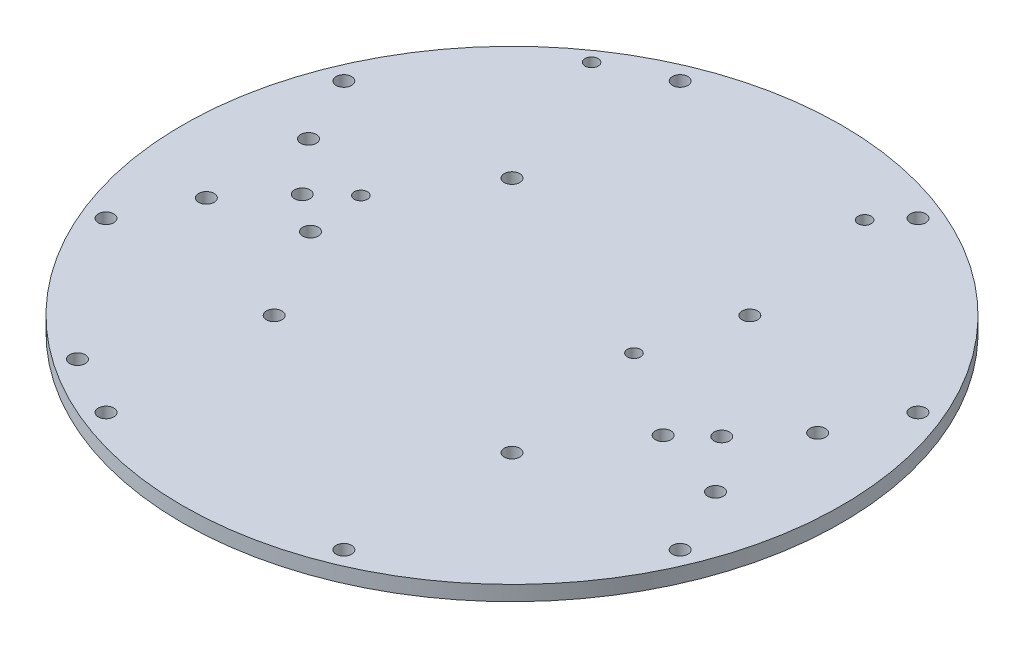
ISO-10303-21;
HEADER;
FILE_DESCRIPTION(('STEP AP214'),'2;1');
FILE_NAME('part.step','',(''),(''),'','','');
FILE_SCHEMA(('AUTOMOTIVE_DESIGN { 1 0 10303 214 1 1 1 1 }'));
ENDSEC;
DATA;
#1=APPLICATION_CONTEXT('core data for automotive mechanical design processes');
#2=APPLICATION_PROTOCOL_DEFINITION('international standard','automotive_design',2000,#1);
#3=PRODUCT_CONTEXT('',#1,'mechanical');
#4=PRODUCT('Part','Part','',(#3));
#5=PRODUCT_RELATED_PRODUCT_CATEGORY('part','',(#4));
#6=PRODUCT_DEFINITION_FORMATION('','',#4);
#7=PRODUCT_DEFINITION_CONTEXT('part definition',#1,'design');
#8=PRODUCT_DEFINITION('design','',#6,#7);
#9=PRODUCT_DEFINITION_SHAPE('','',#8);
#10=(LENGTH_UNIT() NAMED_UNIT(*) SI_UNIT(.MILLI.,.METRE.));
#11=(NAMED_UNIT(*) PLANE_ANGLE_UNIT() SI_UNIT($,.RADIAN.));
#12=(NAMED_UNIT(*) SI_UNIT($,.STERADIAN.) SOLID_ANGLE_UNIT());
#13=UNCERTAINTY_MEASURE_WITH_UNIT(LENGTH_MEASURE(1.E-05),#10,'distance_accuracy_value','');
#14=(GEOMETRIC_REPRESENTATION_CONTEXT(3) GLOBAL_UNCERTAINTY_ASSIGNED_CONTEXT((#13)) GLOBAL_UNIT_ASSIGNED_CONTEXT((#10,
#11,#12)) REPRESENTATION_CONTEXT('',''));
#15=CARTESIAN_POINT('',(0.,0.,0.));
#16=DIRECTION('',(0.,0.,1.));
#17=DIRECTION('',(1.,0.,0.));
#18=AXIS2_PLACEMENT_3D('',#15,#16,#17);
#19=CARTESIAN_POINT('',(0.,3.175,0.));
#20=DIRECTION('',(0.,1.,0.));
#21=DIRECTION('',(0.,0.,1.));
#22=AXIS2_PLACEMENT_3D('',#19,#20,#21);
#23=PLANE('',#22);
#24=CARTESIAN_POINT('',(-38.1,3.175,54.2));
#25=DIRECTION('',(0.,1.,0.));
#26=DIRECTION('',(0.,0.,1.));
#27=AXIS2_PLACEMENT_3D('',#24,#25,#26);
#28=CIRCLE('',#27,1.65);
#29=CARTESIAN_POINT('',(-38.1,3.175,55.85));
#30=VERTEX_POINT('',#29);
#31=EDGE_CURVE('E104',#30,#30,#28,.T.);
#32=ORIENTED_EDGE('',*,*,#31,.F.);
#33=EDGE_LOOP('',(#32));
#34=FACE_BOUND('',#33,.T.);
#35=CARTESIAN_POINT('',(-38.1,3.175,-6.));
#36=DIRECTION('',(0.,1.,0.));
#37=DIRECTION('',(0.,0.,1.));
#38=AXIS2_PLACEMENT_3D('',#35,#36,#37);
#39=CIRCLE('',#38,1.4);
#40=CARTESIAN_POINT('',(-38.1,3.175,-4.6));
#41=VERTEX_POINT('',#40);
#42=EDGE_CURVE('E108',#41,#41,#39,.T.);
#43=ORIENTED_EDGE('',*,*,#42,.F.);
#44=EDGE_LOOP('',(#43));
#45=FACE_BOUND('',#44,.T.);
#46=CARTESIAN_POINT('',(-38.1,3.175,-55.));
#47=DIRECTION('',(0.,1.,0.));
#48=DIRECTION('',(0.,0.,1.));
#49=AXIS2_PLACEMENT_3D('',#46,#47,#48);
#50=CIRCLE('',#49,1.4);
#51=CARTESIAN_POINT('',(-38.1,3.175,-53.6));
#52=VERTEX_POINT('',#51);
#53=EDGE_CURVE('E112',#52,#52,#50,.T.);
#54=ORIENTED_EDGE('',*,*,#53,.F.);
#55=EDGE_LOOP('',(#54));
#56=FACE_BOUND('',#55,.T.);
#57=CARTESIAN_POINT('',(19.9,3.175,-6.));
#58=DIRECTION('',(0.,1.,0.));
#59=DIRECTION('',(0.,0.,1.));
#60=AXIS2_PLACEMENT_3D('',#57,#58,#59);
#61=CIRCLE('',#60,1.4);
#62=CARTESIAN_POINT('',(19.9,3.175,-4.6));
#63=VERTEX_POINT('',#62);
#64=EDGE_CURVE('E116',#63,#63,#61,.T.);
#65=ORIENTED_EDGE('',*,*,#64,.F.);
#66=EDGE_LOOP('',(#65));
#67=FACE_BOUND('',#66,.T.);
#68=CARTESIAN_POINT('',(-36.8,3.175,6.));
#69=DIRECTION('',(0.,1.,0.));
#70=DIRECTION('',(0.,0.,1.));
#71=AXIS2_PLACEMENT_3D('',#68,#69,#70);
#72=CIRCLE('',#71,1.65);
#73=CARTESIAN_POINT('',(-36.8,3.175,7.65));
#74=VERTEX_POINT('',#73);
#75=EDGE_CURVE('E120',#74,#74,#72,.T.);
#76=ORIENTED_EDGE('',*,*,#75,.F.);
#77=EDGE_LOOP('',(#76));
#78=FACE_BOUND('',#77,.T.);
#79=CARTESIAN_POINT('',(38.1,3.175,6.));
#80=DIRECTION('',(0.,1.,0.));
#81=DIRECTION('',(0.,0.,1.));
#82=AXIS2_PLACEMENT_3D('',#79,#80,#81);
#83=CIRCLE('',#82,1.65);
#84=CARTESIAN_POINT('',(38.1,3.175,7.65));
#85=VERTEX_POINT('',#84);
#86=EDGE_CURVE('E124',#85,#85,#83,.T.);
#87=ORIENTED_EDGE('',*,*,#86,.F.);
#88=EDGE_LOOP('',(#87));
#89=FACE_BOUND('',#88,.T.);
#90=CARTESIAN_POINT('',(19.9,3.175,-55.));
#91=DIRECTION('',(0.,1.,0.));
#92=DIRECTION('',(0.,0.,1.));
#93=AXIS2_PLACEMENT_3D('',#90,#91,#92);
#94=CIRCLE('',#93,1.4);
#95=CARTESIAN_POINT('',(19.9,3.175,-53.6));
#96=VERTEX_POINT('',#95);
#97=EDGE_CURVE('E128',#96,#96,#94,.T.);
#98=ORIENTED_EDGE('',*,*,#97,.F.);
#99=EDGE_LOOP('',(#98));
#100=FACE_BOUND('',#99,.T.);
#101=CARTESIAN_POINT('',(-25.2571065360959,3.175,25.2571065360959));
#102=DIRECTION('',(0.,1.,0.));
#103=DIRECTION('',(0.,0.,1.));
#104=AXIS2_PLACEMENT_3D('',#101,#102,#103);
#105=CIRCLE('',#104,1.65);
#106=CARTESIAN_POINT('',(-25.2571065360959,3.175,26.9071065360959));
#107=VERTEX_POINT('',#106);
#108=EDGE_CURVE('E132',#107,#107,#105,.T.);
#109=ORIENTED_EDGE('',*,*,#108,.F.);
#110=EDGE_LOOP('',(#109));
#111=FACE_BOUND('',#110,.T.);
#112=CARTESIAN_POINT('',(-60.9760491457449,3.175,25.257106536096));
#113=DIRECTION('',(0.,1.,0.));
#114=DIRECTION('',(0.,0.,1.));
#115=AXIS2_PLACEMENT_3D('',#112,#113,#114);
#116=CIRCLE('',#115,1.65);
#117=CARTESIAN_POINT('',(-60.9760491457449,3.175,26.907106536096));
#118=VERTEX_POINT('',#117);
#119=EDGE_CURVE('E136',#118,#118,#116,.T.);
#120=ORIENTED_EDGE('',*,*,#119,.F.);
#121=EDGE_LOOP('',(#120));
#122=FACE_BOUND('',#121,.T.);
#123=CARTESIAN_POINT('',(-25.2571065360959,3.175,60.976049145745));
#124=DIRECTION('',(0.,1.,0.));
#125=DIRECTION('',(0.,0.,1.));
#126=AXIS2_PLACEMENT_3D('',#123,#124,#125);
#127=CIRCLE('',#126,1.65);
#128=CARTESIAN_POINT('',(-25.2571065360959,3.175,62.626049145745));
#129=VERTEX_POINT('',#128);
#130=EDGE_CURVE('E140',#129,#129,#127,.T.);
#131=ORIENTED_EDGE('',*,*,#130,.F.);
#132=EDGE_LOOP('',(#131));
#133=FACE_BOUND('',#132,.T.);
#134=CARTESIAN_POINT('',(25.2571065360959,3.175,60.976049145745));
#135=DIRECTION('',(0.,1.,0.));
#136=DIRECTION('',(0.,0.,-1.));
#137=AXIS2_PLACEMENT_3D('',#134,#135,#136);
#138=CIRCLE('',#137,1.65);
#139=CARTESIAN_POINT('',(25.2571065360959,3.175,59.326049145745));
#140=VERTEX_POINT('',#139);
#141=EDGE_CURVE('E144',#140,#140,#138,.T.);
#142=ORIENTED_EDGE('',*,*,#141,.F.);
#143=EDGE_LOOP('',(#142));
#144=FACE_BOUND('',#143,.T.);
#145=CARTESIAN_POINT('',(60.9760491457449,3.175,25.257106536096));
#146=DIRECTION('',(0.,1.,0.));
#147=DIRECTION('',(0.,0.,-1.));
#148=AXIS2_PLACEMENT_3D('',#145,#146,#147);
#149=CIRCLE('',#148,1.65);
#150=CARTESIAN_POINT('',(60.9760491457449,3.175,23.607106536096));
#151=VERTEX_POINT('',#150);
#152=EDGE_CURVE('E148',#151,#151,#149,.T.);
#153=ORIENTED_EDGE('',*,*,#152,.F.);
#154=EDGE_LOOP('',(#153));
#155=FACE_BOUND('',#154,.T.);
#156=CARTESIAN_POINT('',(25.2571065360959,3.175,25.2571065360959));
#157=DIRECTION('',(0.,1.,0.));
#158=DIRECTION('',(0.,0.,-1.));
#159=AXIS2_PLACEMENT_3D('',#156,#157,#158);
#160=CIRCLE('',#159,1.65);
#161=CARTESIAN_POINT('',(25.2571065360959,3.175,23.607106536096));
#162=VERTEX_POINT('',#161);
#163=EDGE_CURVE('E152',#162,#162,#160,.T.);
#164=ORIENTED_EDGE('',*,*,#163,.F.);
#165=EDGE_LOOP('',(#164));
#166=FACE_BOUND('',#165,.T.);
#167=CARTESIAN_POINT('',(60.9760491457449,3.175,-25.257106536096));
#168=DIRECTION('',(0.,1.,0.));
#169=DIRECTION('',(0.,0.,1.));
#170=AXIS2_PLACEMENT_3D('',#167,#168,#169);
#171=CIRCLE('',#170,1.65);
#172=CARTESIAN_POINT('',(60.9760491457449,3.175,-23.607106536096));
#173=VERTEX_POINT('',#172);
#174=EDGE_CURVE('E156',#173,#173,#171,.T.);
#175=ORIENTED_EDGE('',*,*,#174,.F.);
#176=EDGE_LOOP('',(#175));
#177=FACE_BOUND('',#176,.T.);
#178=CARTESIAN_POINT('',(25.2571065360959,3.175,-25.2571065360959));
#179=DIRECTION('',(0.,1.,0.));
#180=DIRECTION('',(0.,0.,1.));
#181=AXIS2_PLACEMENT_3D('',#178,#179,#180);
#182=CIRCLE('',#181,1.65);
#183=CARTESIAN_POINT('',(25.2571065360959,3.175,-23.6071065360959));
#184=VERTEX_POINT('',#183);
#185=EDGE_CURVE('E160',#184,#184,#182,.T.);
#186=ORIENTED_EDGE('',*,*,#185,.F.);
#187=EDGE_LOOP('',(#186));
#188=FACE_BOUND('',#187,.T.);
#189=CARTESIAN_POINT('',(-25.2571065360959,3.175,-25.2571065360959));
#190=DIRECTION('',(0.,1.,0.));
#191=DIRECTION('',(0.,0.,-1.));
#192=AXIS2_PLACEMENT_3D('',#189,#190,#191);
#193=CIRCLE('',#192,1.65);
#194=CARTESIAN_POINT('',(-25.2571065360959,3.175,-26.9071065360959));
#195=VERTEX_POINT('',#194);
#196=EDGE_CURVE('E164',#195,#195,#193,.T.);
#197=ORIENTED_EDGE('',*,*,#196,.F.);
#198=EDGE_LOOP('',(#197));
#199=FACE_BOUND('',#198,.T.);
#200=CARTESIAN_POINT('',(-60.9760491457449,3.175,-25.257106536096));
#201=DIRECTION('',(0.,1.,0.));
#202=DIRECTION('',(0.,0.,-1.));
#203=AXIS2_PLACEMENT_3D('',#200,#201,#202);
#204=CIRCLE('',#203,1.65);
#205=CARTESIAN_POINT('',(-60.9760491457449,3.175,-26.907106536096));
#206=VERTEX_POINT('',#205);
#207=EDGE_CURVE('E168',#206,#206,#204,.T.);
#208=ORIENTED_EDGE('',*,*,#207,.F.);
#209=EDGE_LOOP('',(#208));
#210=FACE_BOUND('',#209,.T.);
#211=CARTESIAN_POINT('',(-25.2571065360959,3.175,-60.976049145745));
#212=DIRECTION('',(0.,1.,0.));
#213=DIRECTION('',(0.,0.,-1.));
#214=AXIS2_PLACEMENT_3D('',#211,#212,#213);
#215=CIRCLE('',#214,1.65);
#216=CARTESIAN_POINT('',(-25.2571065360959,3.175,-62.626049145745));
#217=VERTEX_POINT('',#216);
#218=EDGE_CURVE('E172',#217,#217,#215,.T.);
#219=ORIENTED_EDGE('',*,*,#218,.F.);
#220=EDGE_LOOP('',(#219));
#221=FACE_BOUND('',#220,.T.);
#222=CARTESIAN_POINT('',(25.2571065360959,3.175,-60.976049145745));
#223=DIRECTION('',(0.,1.,0.));
#224=DIRECTION('',(0.,0.,1.));
#225=AXIS2_PLACEMENT_3D('',#222,#223,#224);
#226=CIRCLE('',#225,1.65);
#227=CARTESIAN_POINT('',(25.2571065360959,3.175,-59.326049145745));
#228=VERTEX_POINT('',#227);
#229=EDGE_CURVE('E176',#228,#228,#226,.T.);
#230=ORIENTED_EDGE('',*,*,#229,.F.);
#231=EDGE_LOOP('',(#230));
#232=FACE_BOUND('',#231,.T.);
#233=CARTESIAN_POINT('',(-54.075,3.175,-10.85));
#234=DIRECTION('',(0.,1.,0.));
#235=DIRECTION('',(0.,0.,-1.));
#236=AXIS2_PLACEMENT_3D('',#233,#234,#235);
#237=CIRCLE('',#236,1.651);
#238=CARTESIAN_POINT('',(-54.075,3.175,-12.501));
#239=VERTEX_POINT('',#238);
#240=EDGE_CURVE('E180',#239,#239,#237,.T.);
#241=ORIENTED_EDGE('',*,*,#240,.F.);
#242=EDGE_LOOP('',(#241));
#243=FACE_BOUND('',#242,.T.);
#244=CARTESIAN_POINT('',(54.075,3.175,10.85));
#245=DIRECTION('',(0.,1.,0.));
#246=DIRECTION('',(0.,0.,1.));
#247=AXIS2_PLACEMENT_3D('',#244,#245,#246);
#248=CIRCLE('',#247,1.651);
#249=CARTESIAN_POINT('',(54.075,3.175,12.501));
#250=VERTEX_POINT('',#249);
#251=EDGE_CURVE('E70',#250,#250,#248,.T.);
#252=ORIENTED_EDGE('',*,*,#251,.F.);
#253=EDGE_LOOP('',(#252));
#254=FACE_BOUND('',#253,.T.);
#255=CARTESIAN_POINT('',(44.55,3.175,0.));
#256=DIRECTION('',(0.,1.,0.));
#257=DIRECTION('',(0.,0.,1.));
#258=AXIS2_PLACEMENT_3D('',#255,#256,#257);
#259=CIRCLE('',#258,1.651);
#260=CARTESIAN_POINT('',(44.55,3.175,1.65100000000002));
#261=VERTEX_POINT('',#260);
#262=EDGE_CURVE('E50',#261,#261,#259,.T.);
#263=ORIENTED_EDGE('',*,*,#262,.F.);
#264=EDGE_LOOP('',(#263));
#265=FACE_BOUND('',#264,.T.);
#266=CARTESIAN_POINT('',(0.,3.175,0.));
#267=DIRECTION('',(0.,1.,0.));
#268=DIRECTION('',(0.,0.,1.));
#269=AXIS2_PLACEMENT_3D('',#266,#267,#268);
#270=CIRCLE('',#269,70.);
#271=CARTESIAN_POINT('',(0.,3.175,70.));
#272=VERTEX_POINT('',#271);
#273=EDGE_CURVE('E11',#272,#272,#270,.T.);
#274=ORIENTED_EDGE('',*,*,#273,.T.);
#275=EDGE_LOOP('',(#274));
#276=FACE_BOUND('',#275,.T.);
#277=CARTESIAN_POINT('',(54.075,3.175,-10.85));
#278=DIRECTION('',(0.,1.,0.));
#279=DIRECTION('',(0.,0.,1.));
#280=AXIS2_PLACEMENT_3D('',#277,#278,#279);
#281=CIRCLE('',#280,1.651);
#282=CARTESIAN_POINT('',(54.075,3.175,-9.199));
#283=VERTEX_POINT('',#282);
#284=EDGE_CURVE('E61',#283,#283,#281,.T.);
#285=ORIENTED_EDGE('',*,*,#284,.F.);
#286=EDGE_LOOP('',(#285));
#287=FACE_BOUND('',#286,.T.);
#288=CARTESIAN_POINT('',(-54.075,3.175,10.85));
#289=DIRECTION('',(0.,1.,0.));
#290=DIRECTION('',(0.,0.,-1.));
#291=AXIS2_PLACEMENT_3D('',#288,#289,#290);
#292=CIRCLE('',#291,1.651);
#293=CARTESIAN_POINT('',(-54.075,3.175,9.19900000000002));
#294=VERTEX_POINT('',#293);
#295=EDGE_CURVE('E190',#294,#294,#292,.T.);
#296=ORIENTED_EDGE('',*,*,#295,.F.);
#297=EDGE_LOOP('',(#296));
#298=FACE_BOUND('',#297,.T.);
#299=CARTESIAN_POINT('',(-44.55,3.175,0.));
#300=DIRECTION('',(0.,1.,0.));
#301=DIRECTION('',(0.,0.,-1.));
#302=AXIS2_PLACEMENT_3D('',#299,#300,#301);
#303=CIRCLE('',#302,1.651);
#304=CARTESIAN_POINT('',(-44.55,3.175,-1.65099999999997));
#305=VERTEX_POINT('',#304);
#306=EDGE_CURVE('E193',#305,#305,#303,.T.);
#307=ORIENTED_EDGE('',*,*,#306,.F.);
#308=EDGE_LOOP('',(#307));
#309=FACE_BOUND('',#308,.T.);
#310=ADVANCED_FACE('F36',(#34,#45,#56,#67,#78,#89,#100,#111,#122,#133,#144,#155,#166,#177,#188,
#199,#210,#221,#232,#243,#254,#265,#276,#287,#298,#309),#23,.T.);
#311=CARTESIAN_POINT('',(0.,0.,0.));
#312=DIRECTION('',(0.,1.,0.));
#313=DIRECTION('',(0.,0.,1.));
#314=AXIS2_PLACEMENT_3D('',#311,#312,#313);
#315=PLANE('',#314);
#316=CARTESIAN_POINT('',(-38.1,0.,54.2));
#317=DIRECTION('',(0.,1.,0.));
#318=DIRECTION('',(0.,0.,1.));
#319=AXIS2_PLACEMENT_3D('',#316,#317,#318);
#320=CIRCLE('',#319,1.65);
#321=CARTESIAN_POINT('',(-38.1,0.,55.85));
#322=VERTEX_POINT('',#321);
#323=EDGE_CURVE('E324',#322,#322,#320,.T.);
#324=ORIENTED_EDGE('',*,*,#323,.T.);
#325=EDGE_LOOP('',(#324));
#326=FACE_BOUND('',#325,.T.);
#327=CARTESIAN_POINT('',(-38.1,0.,-6.));
#328=DIRECTION('',(0.,1.,0.));
#329=DIRECTION('',(0.,0.,1.));
#330=AXIS2_PLACEMENT_3D('',#327,#328,#329);
#331=CIRCLE('',#330,1.4);
#332=CARTESIAN_POINT('',(-38.1,0.,-4.6));
#333=VERTEX_POINT('',#332);
#334=EDGE_CURVE('E445',#333,#333,#331,.T.);
#335=ORIENTED_EDGE('',*,*,#334,.T.);
#336=EDGE_LOOP('',(#335));
#337=FACE_BOUND('',#336,.T.);
#338=CARTESIAN_POINT('',(-38.1,0.,-55.));
#339=DIRECTION('',(0.,1.,0.));
#340=DIRECTION('',(0.,0.,1.));
#341=AXIS2_PLACEMENT_3D('',#338,#339,#340);
#342=CIRCLE('',#341,1.4);
#343=CARTESIAN_POINT('',(-38.1,0.,-53.6));
#344=VERTEX_POINT('',#343);
#345=EDGE_CURVE('E347',#344,#344,#342,.T.);
#346=ORIENTED_EDGE('',*,*,#345,.T.);
#347=EDGE_LOOP('',(#346));
#348=FACE_BOUND('',#347,.T.);
#349=CARTESIAN_POINT('',(19.9,0.,-6.));
#350=DIRECTION('',(0.,1.,0.));
#351=DIRECTION('',(0.,0.,1.));
#352=AXIS2_PLACEMENT_3D('',#349,#350,#351);
#353=CIRCLE('',#352,1.4);
#354=CARTESIAN_POINT('',(19.9,0.,-4.6));
#355=VERTEX_POINT('',#354);
#356=EDGE_CURVE('E441',#355,#355,#353,.T.);
#357=ORIENTED_EDGE('',*,*,#356,.T.);
#358=EDGE_LOOP('',(#357));
#359=FACE_BOUND('',#358,.T.);
#360=CARTESIAN_POINT('',(-36.8,0.,6.));
#361=DIRECTION('',(0.,1.,0.));
#362=DIRECTION('',(0.,0.,1.));
#363=AXIS2_PLACEMENT_3D('',#360,#361,#362);
#364=CIRCLE('',#363,1.65);
#365=CARTESIAN_POINT('',(-36.8,0.,7.65));
#366=VERTEX_POINT('',#365);
#367=EDGE_CURVE('E320',#366,#366,#364,.T.);
#368=ORIENTED_EDGE('',*,*,#367,.T.);
#369=EDGE_LOOP('',(#368));
#370=FACE_BOUND('',#369,.T.);
#371=CARTESIAN_POINT('',(38.1,0.,6.));
#372=DIRECTION('',(0.,1.,0.));
#373=DIRECTION('',(0.,0.,1.));
#374=AXIS2_PLACEMENT_3D('',#371,#372,#373);
#375=CIRCLE('',#374,1.65);
#376=CARTESIAN_POINT('',(38.1,0.,7.65));
#377=VERTEX_POINT('',#376);
#378=EDGE_CURVE('E327',#377,#377,#375,.T.);
#379=ORIENTED_EDGE('',*,*,#378,.T.);
#380=EDGE_LOOP('',(#379));
#381=FACE_BOUND('',#380,.T.);
#382=CARTESIAN_POINT('',(19.9,0.,-55.));
#383=DIRECTION('',(0.,1.,0.));
#384=DIRECTION('',(0.,0.,1.));
#385=AXIS2_PLACEMENT_3D('',#382,#383,#384);
#386=CIRCLE('',#385,1.4);
#387=CARTESIAN_POINT('',(19.9,0.,-53.6));
#388=VERTEX_POINT('',#387);
#389=EDGE_CURVE('E346',#388,#388,#386,.T.);
#390=ORIENTED_EDGE('',*,*,#389,.T.);
#391=EDGE_LOOP('',(#390));
#392=FACE_BOUND('',#391,.T.);
#393=CARTESIAN_POINT('',(-25.2571065360959,0.,25.2571065360959));
#394=DIRECTION('',(0.,1.,0.));
#395=DIRECTION('',(0.,0.,1.));
#396=AXIS2_PLACEMENT_3D('',#393,#394,#395);
#397=CIRCLE('',#396,1.65);
#398=CARTESIAN_POINT('',(-25.2571065360959,0.,26.9071065360959));
#399=VERTEX_POINT('',#398);
#400=EDGE_CURVE('E354',#399,#399,#397,.T.);
#401=ORIENTED_EDGE('',*,*,#400,.T.);
#402=EDGE_LOOP('',(#401));
#403=FACE_BOUND('',#402,.T.);
#404=CARTESIAN_POINT('',(-60.9760491457449,0.,25.257106536096));
#405=DIRECTION('',(0.,1.,0.));
#406=DIRECTION('',(0.,0.,1.));
#407=AXIS2_PLACEMENT_3D('',#404,#405,#406);
#408=CIRCLE('',#407,1.65);
#409=CARTESIAN_POINT('',(-60.9760491457449,0.,26.907106536096));
#410=VERTEX_POINT('',#409);
#411=EDGE_CURVE('E437',#410,#410,#408,.T.);
#412=ORIENTED_EDGE('',*,*,#411,.T.);
#413=EDGE_LOOP('',(#412));
#414=FACE_BOUND('',#413,.T.);
#415=CARTESIAN_POINT('',(-25.2571065360959,0.,60.976049145745));
#416=DIRECTION('',(0.,1.,0.));
#417=DIRECTION('',(0.,0.,1.));
#418=AXIS2_PLACEMENT_3D('',#415,#416,#417);
#419=CIRCLE('',#418,1.65);
#420=CARTESIAN_POINT('',(-25.2571065360959,0.,62.626049145745));
#421=VERTEX_POINT('',#420);
#422=EDGE_CURVE('E435',#421,#421,#419,.T.);
#423=ORIENTED_EDGE('',*,*,#422,.T.);
#424=EDGE_LOOP('',(#423));
#425=FACE_BOUND('',#424,.T.);
#426=CARTESIAN_POINT('',(25.2571065360959,0.,60.976049145745));
#427=DIRECTION('',(0.,1.,0.));
#428=DIRECTION('',(0.,0.,-1.));
#429=AXIS2_PLACEMENT_3D('',#426,#427,#428);
#430=CIRCLE('',#429,1.65);
#431=CARTESIAN_POINT('',(25.2571065360959,0.,59.326049145745));
#432=VERTEX_POINT('',#431);
#433=EDGE_CURVE('E377',#432,#432,#430,.T.);
#434=ORIENTED_EDGE('',*,*,#433,.T.);
#435=EDGE_LOOP('',(#434));
#436=FACE_BOUND('',#435,.T.);
#437=CARTESIAN_POINT('',(60.9760491457449,0.,25.257106536096));
#438=DIRECTION('',(0.,1.,0.));
#439=DIRECTION('',(0.,0.,-1.));
#440=AXIS2_PLACEMENT_3D('',#437,#438,#439);
#441=CIRCLE('',#440,1.65);
#442=CARTESIAN_POINT('',(60.9760491457449,0.,23.607106536096));
#443=VERTEX_POINT('',#442);
#444=EDGE_CURVE('E376',#443,#443,#441,.T.);
#445=ORIENTED_EDGE('',*,*,#444,.T.);
#446=EDGE_LOOP('',(#445));
#447=FACE_BOUND('',#446,.T.);
#448=CARTESIAN_POINT('',(25.2571065360959,0.,25.2571065360959));
#449=DIRECTION('',(0.,1.,0.));
#450=DIRECTION('',(0.,0.,-1.));
#451=AXIS2_PLACEMENT_3D('',#448,#449,#450);
#452=CIRCLE('',#451,1.65);
#453=CARTESIAN_POINT('',(25.2571065360959,0.,23.607106536096));
#454=VERTEX_POINT('',#453);
#455=EDGE_CURVE('E389',#454,#454,#452,.T.);
#456=ORIENTED_EDGE('',*,*,#455,.T.);
#457=EDGE_LOOP('',(#456));
#458=FACE_BOUND('',#457,.T.);
#459=CARTESIAN_POINT('',(60.9760491457449,0.,-25.257106536096));
#460=DIRECTION('',(0.,1.,0.));
#461=DIRECTION('',(0.,0.,1.));
#462=AXIS2_PLACEMENT_3D('',#459,#460,#461);
#463=CIRCLE('',#462,1.65);
#464=CARTESIAN_POINT('',(60.9760491457449,0.,-23.607106536096));
#465=VERTEX_POINT('',#464);
#466=EDGE_CURVE('E406',#465,#465,#463,.T.);
#467=ORIENTED_EDGE('',*,*,#466,.T.);
#468=EDGE_LOOP('',(#467));
#469=FACE_BOUND('',#468,.T.);
#470=CARTESIAN_POINT('',(25.2571065360959,0.,-25.2571065360959));
#471=DIRECTION('',(0.,1.,0.));
#472=DIRECTION('',(0.,0.,1.));
#473=AXIS2_PLACEMENT_3D('',#470,#471,#472);
#474=CIRCLE('',#473,1.65);
#475=CARTESIAN_POINT('',(25.2571065360959,0.,-23.6071065360959));
#476=VERTEX_POINT('',#475);
#477=EDGE_CURVE('E397',#476,#476,#474,.T.);
#478=ORIENTED_EDGE('',*,*,#477,.T.);
#479=EDGE_LOOP('',(#478));
#480=FACE_BOUND('',#479,.T.);
#481=CARTESIAN_POINT('',(-25.2571065360959,0.,-25.2571065360959));
#482=DIRECTION('',(0.,1.,0.));
#483=DIRECTION('',(0.,0.,-1.));
#484=AXIS2_PLACEMENT_3D('',#481,#482,#483);
#485=CIRCLE('',#484,1.65);
#486=CARTESIAN_POINT('',(-25.2571065360959,0.,-26.9071065360959));
#487=VERTEX_POINT('',#486);
#488=EDGE_CURVE('E355',#487,#487,#485,.T.);
#489=ORIENTED_EDGE('',*,*,#488,.T.);
#490=EDGE_LOOP('',(#489));
#491=FACE_BOUND('',#490,.T.);
#492=CARTESIAN_POINT('',(-60.9760491457449,0.,-25.257106536096));
#493=DIRECTION('',(0.,1.,0.));
#494=DIRECTION('',(0.,0.,-1.));
#495=AXIS2_PLACEMENT_3D('',#492,#493,#494);
#496=CIRCLE('',#495,1.65);
#497=CARTESIAN_POINT('',(-60.9760491457449,0.,-26.907106536096));
#498=VERTEX_POINT('',#497);
#499=EDGE_CURVE('E366',#498,#498,#496,.T.);
#500=ORIENTED_EDGE('',*,*,#499,.T.);
#501=EDGE_LOOP('',(#500));
#502=FACE_BOUND('',#501,.T.);
#503=CARTESIAN_POINT('',(-25.2571065360959,0.,-60.976049145745));
#504=DIRECTION('',(0.,1.,0.));
#505=DIRECTION('',(0.,0.,-1.));
#506=AXIS2_PLACEMENT_3D('',#503,#504,#505);
#507=CIRCLE('',#506,1.65);
#508=CARTESIAN_POINT('',(-25.2571065360959,0.,-62.626049145745));
#509=VERTEX_POINT('',#508);
#510=EDGE_CURVE('E345',#509,#509,#507,.T.);
#511=ORIENTED_EDGE('',*,*,#510,.T.);
#512=EDGE_LOOP('',(#511));
#513=FACE_BOUND('',#512,.T.);
#514=CARTESIAN_POINT('',(25.2571065360959,0.,-60.976049145745));
#515=DIRECTION('',(0.,1.,0.));
#516=DIRECTION('',(0.,0.,1.));
#517=AXIS2_PLACEMENT_3D('',#514,#515,#516);
#518=CIRCLE('',#517,1.65);
#519=CARTESIAN_POINT('',(25.2571065360959,0.,-59.326049145745));
#520=VERTEX_POINT('',#519);
#521=EDGE_CURVE('E205',#520,#520,#518,.T.);
#522=ORIENTED_EDGE('',*,*,#521,.T.);
#523=EDGE_LOOP('',(#522));
#524=FACE_BOUND('',#523,.T.);
#525=CARTESIAN_POINT('',(0.,0.,0.));
#526=DIRECTION('',(0.,1.,0.));
#527=DIRECTION('',(0.,0.,1.));
#528=AXIS2_PLACEMENT_3D('',#525,#526,#527);
#529=CIRCLE('',#528,70.);
#530=CARTESIAN_POINT('',(0.,0.,70.));
#531=VERTEX_POINT('',#530);
#532=EDGE_CURVE('E40',#531,#531,#529,.T.);
#533=ORIENTED_EDGE('',*,*,#532,.F.);
#534=EDGE_LOOP('',(#533));
#535=FACE_BOUND('',#534,.T.);
#536=CARTESIAN_POINT('',(44.55,0.,0.));
#537=DIRECTION('',(0.,1.,0.));
#538=DIRECTION('',(0.,0.,1.));
#539=AXIS2_PLACEMENT_3D('',#536,#537,#538);
#540=CIRCLE('',#539,1.651);
#541=CARTESIAN_POINT('',(44.55,0.,1.65100000000002));
#542=VERTEX_POINT('',#541);
#543=EDGE_CURVE('E53',#542,#542,#540,.T.);
#544=ORIENTED_EDGE('',*,*,#543,.T.);
#545=EDGE_LOOP('',(#544));
#546=FACE_BOUND('',#545,.T.);
#547=CARTESIAN_POINT('',(54.075,0.,-10.85));
#548=DIRECTION('',(0.,1.,0.));
#549=DIRECTION('',(0.,0.,1.));
#550=AXIS2_PLACEMENT_3D('',#547,#548,#549);
#551=CIRCLE('',#550,1.651);
#552=CARTESIAN_POINT('',(54.075,0.,-9.199));
#553=VERTEX_POINT('',#552);
#554=EDGE_CURVE('E66',#553,#553,#551,.T.);
#555=ORIENTED_EDGE('',*,*,#554,.T.);
#556=EDGE_LOOP('',(#555));
#557=FACE_BOUND('',#556,.T.);
#558=CARTESIAN_POINT('',(54.075,0.,10.85));
#559=DIRECTION('',(0.,1.,0.));
#560=DIRECTION('',(0.,0.,1.));
#561=AXIS2_PLACEMENT_3D('',#558,#559,#560);
#562=CIRCLE('',#561,1.651);
#563=CARTESIAN_POINT('',(54.075,0.,12.501));
#564=VERTEX_POINT('',#563);
#565=EDGE_CURVE('E67',#564,#564,#562,.T.);
#566=ORIENTED_EDGE('',*,*,#565,.T.);
#567=EDGE_LOOP('',(#566));
#568=FACE_BOUND('',#567,.T.);
#569=CARTESIAN_POINT('',(-54.075,0.,10.85));
#570=DIRECTION('',(0.,1.,0.));
#571=DIRECTION('',(0.,0.,-1.));
#572=AXIS2_PLACEMENT_3D('',#569,#570,#571);
#573=CIRCLE('',#572,1.651);
#574=CARTESIAN_POINT('',(-54.075,0.,9.19900000000002));
#575=VERTEX_POINT('',#574);
#576=EDGE_CURVE('E210',#575,#575,#573,.T.);
#577=ORIENTED_EDGE('',*,*,#576,.T.);
#578=EDGE_LOOP('',(#577));
#579=FACE_BOUND('',#578,.T.);
#580=CARTESIAN_POINT('',(-54.075,0.,-10.85));
#581=DIRECTION('',(0.,1.,0.));
#582=DIRECTION('',(0.,0.,-1.));
#583=AXIS2_PLACEMENT_3D('',#580,#581,#582);
#584=CIRCLE('',#583,1.651);
#585=CARTESIAN_POINT('',(-54.075,0.,-12.501));
#586=VERTEX_POINT('',#585);
#587=EDGE_CURVE('E196',#586,#586,#584,.T.);
#588=ORIENTED_EDGE('',*,*,#587,.T.);
#589=EDGE_LOOP('',(#588));
#590=FACE_BOUND('',#589,.T.);
#591=CARTESIAN_POINT('',(-44.55,0.,0.));
#592=DIRECTION('',(0.,1.,0.));
#593=DIRECTION('',(0.,0.,-1.));
#594=AXIS2_PLACEMENT_3D('',#591,#592,#593);
#595=CIRCLE('',#594,1.651);
#596=CARTESIAN_POINT('',(-44.55,0.,-1.65099999999997));
#597=VERTEX_POINT('',#596);
#598=EDGE_CURVE('E197',#597,#597,#595,.T.);
#599=ORIENTED_EDGE('',*,*,#598,.T.);
#600=EDGE_LOOP('',(#599));
#601=FACE_BOUND('',#600,.T.);
#602=ADVANCED_FACE('F79',(#326,#337,#348,#359,#370,#381,#392,#403,#414,#425,#436,#447,#458,#469,
#480,#491,#502,#513,#524,#535,#546,#557,#568,#579,#590,#601),#315,.F.);
#603=CARTESIAN_POINT('',(0.,3.175,0.));
#604=DIRECTION('',(0.,-1.,0.));
#605=DIRECTION('',(0.,0.,-1.));
#606=AXIS2_PLACEMENT_3D('',#603,#604,#605);
#607=CYLINDRICAL_SURFACE('',#606,70.);
#608=ORIENTED_EDGE('',*,*,#273,.F.);
#609=EDGE_LOOP('',(#608));
#610=FACE_BOUND('',#609,.T.);
#611=ORIENTED_EDGE('',*,*,#532,.T.);
#612=EDGE_LOOP('',(#611));
#613=FACE_BOUND('',#612,.T.);
#614=ADVANCED_FACE('F38',(#610,#613),#607,.T.);
#615=CARTESIAN_POINT('',(44.55,3.175,0.));
#616=DIRECTION('',(0.,-1.,0.));
#617=DIRECTION('',(0.,0.,-1.));
#618=AXIS2_PLACEMENT_3D('',#615,#616,#617);
#619=CYLINDRICAL_SURFACE('',#618,1.651);
#620=ORIENTED_EDGE('',*,*,#262,.T.);
#621=EDGE_LOOP('',(#620));
#622=FACE_BOUND('',#621,.T.);
#623=ORIENTED_EDGE('',*,*,#543,.F.);
#624=EDGE_LOOP('',(#623));
#625=FACE_BOUND('',#624,.T.);
#626=ADVANCED_FACE('F82',(#622,#625),#619,.F.);
#627=CARTESIAN_POINT('',(54.075,3.175,-10.85));
#628=DIRECTION('',(0.,-1.,0.));
#629=DIRECTION('',(0.,0.,-1.));
#630=AXIS2_PLACEMENT_3D('',#627,#628,#629);
#631=CYLINDRICAL_SURFACE('',#630,1.651);
#632=ORIENTED_EDGE('',*,*,#284,.T.);
#633=EDGE_LOOP('',(#632));
#634=FACE_BOUND('',#633,.T.);
#635=ORIENTED_EDGE('',*,*,#554,.F.);
#636=EDGE_LOOP('',(#635));
#637=FACE_BOUND('',#636,.T.);
#638=ADVANCED_FACE('F84',(#634,#637),#631,.F.);
#639=CARTESIAN_POINT('',(54.075,3.175,10.85));
#640=DIRECTION('',(0.,-1.,0.));
#641=DIRECTION('',(0.,0.,-1.));
#642=AXIS2_PLACEMENT_3D('',#639,#640,#641);
#643=CYLINDRICAL_SURFACE('',#642,1.651);
#644=ORIENTED_EDGE('',*,*,#251,.T.);
#645=EDGE_LOOP('',(#644));
#646=FACE_BOUND('',#645,.T.);
#647=ORIENTED_EDGE('',*,*,#565,.F.);
#648=EDGE_LOOP('',(#647));
#649=FACE_BOUND('',#648,.T.);
#650=ADVANCED_FACE('F90',(#646,#649),#643,.F.);
#651=CARTESIAN_POINT('',(-54.075,3.175,10.85));
#652=DIRECTION('',(0.,-1.,0.));
#653=DIRECTION('',(0.,0.,-1.));
#654=AXIS2_PLACEMENT_3D('',#651,#652,#653);
#655=CYLINDRICAL_SURFACE('',#654,1.651);
#656=ORIENTED_EDGE('',*,*,#295,.T.);
#657=EDGE_LOOP('',(#656));
#658=FACE_BOUND('',#657,.T.);
#659=ORIENTED_EDGE('',*,*,#576,.F.);
#660=EDGE_LOOP('',(#659));
#661=FACE_BOUND('',#660,.T.);
#662=ADVANCED_FACE('F225',(#658,#661),#655,.F.);
#663=CARTESIAN_POINT('',(-54.075,3.175,-10.85));
#664=DIRECTION('',(0.,-1.,0.));
#665=DIRECTION('',(0.,0.,-1.));
#666=AXIS2_PLACEMENT_3D('',#663,#664,#665);
#667=CYLINDRICAL_SURFACE('',#666,1.651);
#668=ORIENTED_EDGE('',*,*,#240,.T.);
#669=EDGE_LOOP('',(#668));
#670=FACE_BOUND('',#669,.T.);
#671=ORIENTED_EDGE('',*,*,#587,.F.);
#672=EDGE_LOOP('',(#671));
#673=FACE_BOUND('',#672,.T.);
#674=ADVANCED_FACE('F231',(#670,#673),#667,.F.);
#675=CARTESIAN_POINT('',(-44.55,3.175,0.));
#676=DIRECTION('',(0.,-1.,0.));
#677=DIRECTION('',(0.,0.,-1.));
#678=AXIS2_PLACEMENT_3D('',#675,#676,#677);
#679=CYLINDRICAL_SURFACE('',#678,1.651);
#680=ORIENTED_EDGE('',*,*,#306,.T.);
#681=EDGE_LOOP('',(#680));
#682=FACE_BOUND('',#681,.T.);
#683=ORIENTED_EDGE('',*,*,#598,.F.);
#684=EDGE_LOOP('',(#683));
#685=FACE_BOUND('',#684,.T.);
#686=ADVANCED_FACE('F236',(#682,#685),#679,.F.);
#687=CARTESIAN_POINT('',(25.2571065360959,3.175,-60.976049145745));
#688=DIRECTION('',(0.,-1.,0.));
#689=DIRECTION('',(0.,0.,-1.));
#690=AXIS2_PLACEMENT_3D('',#687,#688,#689);
#691=CYLINDRICAL_SURFACE('',#690,1.65);
#692=ORIENTED_EDGE('',*,*,#229,.T.);
#693=EDGE_LOOP('',(#692));
#694=FACE_BOUND('',#693,.T.);
#695=ORIENTED_EDGE('',*,*,#521,.F.);
#696=EDGE_LOOP('',(#695));
#697=FACE_BOUND('',#696,.T.);
#698=ADVANCED_FACE('F240',(#694,#697),#691,.F.);
#699=CARTESIAN_POINT('',(-25.2571065360959,3.175,-60.976049145745));
#700=DIRECTION('',(0.,-1.,0.));
#701=DIRECTION('',(0.,0.,-1.));
#702=AXIS2_PLACEMENT_3D('',#699,#700,#701);
#703=CYLINDRICAL_SURFACE('',#702,1.65);
#704=ORIENTED_EDGE('',*,*,#218,.T.);
#705=EDGE_LOOP('',(#704));
#706=FACE_BOUND('',#705,.T.);
#707=ORIENTED_EDGE('',*,*,#510,.F.);
#708=EDGE_LOOP('',(#707));
#709=FACE_BOUND('',#708,.T.);
#710=ADVANCED_FACE('F243',(#706,#709),#703,.F.);
#711=CARTESIAN_POINT('',(-60.9760491457449,3.175,-25.257106536096));
#712=DIRECTION('',(0.,-1.,0.));
#713=DIRECTION('',(0.,0.,-1.));
#714=AXIS2_PLACEMENT_3D('',#711,#712,#713);
#715=CYLINDRICAL_SURFACE('',#714,1.65);
#716=ORIENTED_EDGE('',*,*,#207,.T.);
#717=EDGE_LOOP('',(#716));
#718=FACE_BOUND('',#717,.T.);
#719=ORIENTED_EDGE('',*,*,#499,.F.);
#720=EDGE_LOOP('',(#719));
#721=FACE_BOUND('',#720,.T.);
#722=ADVANCED_FACE('F281',(#718,#721),#715,.F.);
#723=CARTESIAN_POINT('',(-25.2571065360959,3.175,-25.2571065360959));
#724=DIRECTION('',(0.,-1.,0.));
#725=DIRECTION('',(0.,0.,-1.));
#726=AXIS2_PLACEMENT_3D('',#723,#724,#725);
#727=CYLINDRICAL_SURFACE('',#726,1.65);
#728=ORIENTED_EDGE('',*,*,#196,.T.);
#729=EDGE_LOOP('',(#728));
#730=FACE_BOUND('',#729,.T.);
#731=ORIENTED_EDGE('',*,*,#488,.F.);
#732=EDGE_LOOP('',(#731));
#733=FACE_BOUND('',#732,.T.);
#734=ADVANCED_FACE('F261',(#730,#733),#727,.F.);
#735=CARTESIAN_POINT('',(25.2571065360959,3.175,-25.2571065360959));
#736=DIRECTION('',(0.,-1.,0.));
#737=DIRECTION('',(0.,0.,-1.));
#738=AXIS2_PLACEMENT_3D('',#735,#736,#737);
#739=CYLINDRICAL_SURFACE('',#738,1.65);
#740=ORIENTED_EDGE('',*,*,#185,.T.);
#741=EDGE_LOOP('',(#740));
#742=FACE_BOUND('',#741,.T.);
#743=ORIENTED_EDGE('',*,*,#477,.F.);
#744=EDGE_LOOP('',(#743));
#745=FACE_BOUND('',#744,.T.);
#746=ADVANCED_FACE('F257',(#742,#745),#739,.F.);
#747=CARTESIAN_POINT('',(60.9760491457449,3.175,-25.257106536096));
#748=DIRECTION('',(0.,-1.,0.));
#749=DIRECTION('',(0.,0.,-1.));
#750=AXIS2_PLACEMENT_3D('',#747,#748,#749);
#751=CYLINDRICAL_SURFACE('',#750,1.65);
#752=ORIENTED_EDGE('',*,*,#174,.T.);
#753=EDGE_LOOP('',(#752));
#754=FACE_BOUND('',#753,.T.);
#755=ORIENTED_EDGE('',*,*,#466,.F.);
#756=EDGE_LOOP('',(#755));
#757=FACE_BOUND('',#756,.T.);
#758=ADVANCED_FACE('F253',(#754,#757),#751,.F.);
#759=CARTESIAN_POINT('',(25.2571065360959,3.175,25.2571065360959));
#760=DIRECTION('',(0.,-1.,0.));
#761=DIRECTION('',(0.,0.,-1.));
#762=AXIS2_PLACEMENT_3D('',#759,#760,#761);
#763=CYLINDRICAL_SURFACE('',#762,1.65);
#764=ORIENTED_EDGE('',*,*,#163,.T.);
#765=EDGE_LOOP('',(#764));
#766=FACE_BOUND('',#765,.T.);
#767=ORIENTED_EDGE('',*,*,#455,.F.);
#768=EDGE_LOOP('',(#767));
#769=FACE_BOUND('',#768,.T.);
#770=ADVANCED_FACE('F249',(#766,#769),#763,.F.);
#771=CARTESIAN_POINT('',(60.9760491457449,3.175,25.257106536096));
#772=DIRECTION('',(0.,-1.,0.));
#773=DIRECTION('',(0.,0.,-1.));
#774=AXIS2_PLACEMENT_3D('',#771,#772,#773);
#775=CYLINDRICAL_SURFACE('',#774,1.65);
#776=ORIENTED_EDGE('',*,*,#152,.T.);
#777=EDGE_LOOP('',(#776));
#778=FACE_BOUND('',#777,.T.);
#779=ORIENTED_EDGE('',*,*,#444,.F.);
#780=EDGE_LOOP('',(#779));
#781=FACE_BOUND('',#780,.T.);
#782=ADVANCED_FACE('F245',(#778,#781),#775,.F.);
#783=CARTESIAN_POINT('',(25.2571065360959,3.175,60.976049145745));
#784=DIRECTION('',(0.,-1.,0.));
#785=DIRECTION('',(0.,0.,-1.));
#786=AXIS2_PLACEMENT_3D('',#783,#784,#785);
#787=CYLINDRICAL_SURFACE('',#786,1.65);
#788=ORIENTED_EDGE('',*,*,#141,.T.);
#789=EDGE_LOOP('',(#788));
#790=FACE_BOUND('',#789,.T.);
#791=ORIENTED_EDGE('',*,*,#433,.F.);
#792=EDGE_LOOP('',(#791));
#793=FACE_BOUND('',#792,.T.);
#794=ADVANCED_FACE('F248',(#790,#793),#787,.F.);
#795=CARTESIAN_POINT('',(-25.2571065360959,3.175,60.976049145745));
#796=DIRECTION('',(0.,-1.,0.));
#797=DIRECTION('',(0.,0.,-1.));
#798=AXIS2_PLACEMENT_3D('',#795,#796,#797);
#799=CYLINDRICAL_SURFACE('',#798,1.65);
#800=ORIENTED_EDGE('',*,*,#130,.T.);
#801=EDGE_LOOP('',(#800));
#802=FACE_BOUND('',#801,.T.);
#803=ORIENTED_EDGE('',*,*,#422,.F.);
#804=EDGE_LOOP('',(#803));
#805=FACE_BOUND('',#804,.T.);
#806=ADVANCED_FACE('F271',(#802,#805),#799,.F.);
#807=CARTESIAN_POINT('',(-60.9760491457449,3.175,25.257106536096));
#808=DIRECTION('',(0.,-1.,0.));
#809=DIRECTION('',(0.,0.,-1.));
#810=AXIS2_PLACEMENT_3D('',#807,#808,#809);
#811=CYLINDRICAL_SURFACE('',#810,1.65);
#812=ORIENTED_EDGE('',*,*,#119,.T.);
#813=EDGE_LOOP('',(#812));
#814=FACE_BOUND('',#813,.T.);
#815=ORIENTED_EDGE('',*,*,#411,.F.);
#816=EDGE_LOOP('',(#815));
#817=FACE_BOUND('',#816,.T.);
#818=ADVANCED_FACE('F267',(#814,#817),#811,.F.);
#819=CARTESIAN_POINT('',(-25.2571065360959,3.175,25.2571065360959));
#820=DIRECTION('',(0.,-1.,0.));
#821=DIRECTION('',(0.,0.,-1.));
#822=AXIS2_PLACEMENT_3D('',#819,#820,#821);
#823=CYLINDRICAL_SURFACE('',#822,1.65);
#824=ORIENTED_EDGE('',*,*,#108,.T.);
#825=EDGE_LOOP('',(#824));
#826=FACE_BOUND('',#825,.T.);
#827=ORIENTED_EDGE('',*,*,#400,.F.);
#828=EDGE_LOOP('',(#827));
#829=FACE_BOUND('',#828,.T.);
#830=ADVANCED_FACE('F263',(#826,#829),#823,.F.);
#831=CARTESIAN_POINT('',(19.9,3.175,-55.));
#832=DIRECTION('',(0.,-1.,0.));
#833=DIRECTION('',(0.,0.,-1.));
#834=AXIS2_PLACEMENT_3D('',#831,#832,#833);
#835=CYLINDRICAL_SURFACE('',#834,1.4);
#836=ORIENTED_EDGE('',*,*,#97,.T.);
#837=EDGE_LOOP('',(#836));
#838=FACE_BOUND('',#837,.T.);
#839=ORIENTED_EDGE('',*,*,#389,.F.);
#840=EDGE_LOOP('',(#839));
#841=FACE_BOUND('',#840,.T.);
#842=ADVANCED_FACE('F266',(#838,#841),#835,.F.);
#843=CARTESIAN_POINT('',(38.1,3.175,6.));
#844=DIRECTION('',(0.,-1.,0.));
#845=DIRECTION('',(0.,0.,-1.));
#846=AXIS2_PLACEMENT_3D('',#843,#844,#845);
#847=CYLINDRICAL_SURFACE('',#846,1.65);
#848=ORIENTED_EDGE('',*,*,#86,.T.);
#849=EDGE_LOOP('',(#848));
#850=FACE_BOUND('',#849,.T.);
#851=ORIENTED_EDGE('',*,*,#378,.F.);
#852=EDGE_LOOP('',(#851));
#853=FACE_BOUND('',#852,.T.);
#854=ADVANCED_FACE('F291',(#850,#853),#847,.F.);
#855=CARTESIAN_POINT('',(-36.8,3.175,6.));
#856=DIRECTION('',(0.,-1.,0.));
#857=DIRECTION('',(0.,0.,-1.));
#858=AXIS2_PLACEMENT_3D('',#855,#856,#857);
#859=CYLINDRICAL_SURFACE('',#858,1.65);
#860=ORIENTED_EDGE('',*,*,#75,.T.);
#861=EDGE_LOOP('',(#860));
#862=FACE_BOUND('',#861,.T.);
#863=ORIENTED_EDGE('',*,*,#367,.F.);
#864=EDGE_LOOP('',(#863));
#865=FACE_BOUND('',#864,.T.);
#866=ADVANCED_FACE('F301',(#862,#865),#859,.F.);
#867=CARTESIAN_POINT('',(19.9,3.175,-6.));
#868=DIRECTION('',(0.,-1.,0.));
#869=DIRECTION('',(0.,0.,-1.));
#870=AXIS2_PLACEMENT_3D('',#867,#868,#869);
#871=CYLINDRICAL_SURFACE('',#870,1.4);
#872=ORIENTED_EDGE('',*,*,#64,.T.);
#873=EDGE_LOOP('',(#872));
#874=FACE_BOUND('',#873,.T.);
#875=ORIENTED_EDGE('',*,*,#356,.F.);
#876=EDGE_LOOP('',(#875));
#877=FACE_BOUND('',#876,.T.);
#878=ADVANCED_FACE('F297',(#874,#877),#871,.F.);
#879=CARTESIAN_POINT('',(-38.1,3.175,-55.));
#880=DIRECTION('',(0.,-1.,0.));
#881=DIRECTION('',(0.,0.,-1.));
#882=AXIS2_PLACEMENT_3D('',#879,#880,#881);
#883=CYLINDRICAL_SURFACE('',#882,1.4);
#884=ORIENTED_EDGE('',*,*,#53,.T.);
#885=EDGE_LOOP('',(#884));
#886=FACE_BOUND('',#885,.T.);
#887=ORIENTED_EDGE('',*,*,#345,.F.);
#888=EDGE_LOOP('',(#887));
#889=FACE_BOUND('',#888,.T.);
#890=ADVANCED_FACE('F293',(#886,#889),#883,.F.);
#891=CARTESIAN_POINT('',(-38.1,3.175,-6.));
#892=DIRECTION('',(0.,-1.,0.));
#893=DIRECTION('',(0.,0.,-1.));
#894=AXIS2_PLACEMENT_3D('',#891,#892,#893);
#895=CYLINDRICAL_SURFACE('',#894,1.4);
#896=ORIENTED_EDGE('',*,*,#42,.T.);
#897=EDGE_LOOP('',(#896));
#898=FACE_BOUND('',#897,.T.);
#899=ORIENTED_EDGE('',*,*,#334,.F.);
#900=EDGE_LOOP('',(#899));
#901=FACE_BOUND('',#900,.T.);
#902=ADVANCED_FACE('F296',(#898,#901),#895,.F.);
#903=CARTESIAN_POINT('',(-38.1,3.175,54.2));
#904=DIRECTION('',(0.,-1.,0.));
#905=DIRECTION('',(0.,0.,-1.));
#906=AXIS2_PLACEMENT_3D('',#903,#904,#905);
#907=CYLINDRICAL_SURFACE('',#906,1.65);
#908=ORIENTED_EDGE('',*,*,#31,.T.);
#909=EDGE_LOOP('',(#908));
#910=FACE_BOUND('',#909,.T.);
#911=ORIENTED_EDGE('',*,*,#323,.F.);
#912=EDGE_LOOP('',(#911));
#913=FACE_BOUND('',#912,.T.);
#914=ADVANCED_FACE('F303',(#910,#913),#907,.F.);
#915=CLOSED_SHELL('',(#310,#602,#614,#626,#638,#650,#662,#674,#686,#698,#710,#722,#734,#746,
#758,#770,#782,#794,#806,#818,#830,#842,#854,#866,#878,#890,#902,#914));
#916=MANIFOLD_SOLID_BREP('B2',#915);
#917=ADVANCED_BREP_SHAPE_REPRESENTATION('',(#18,#916),#14);
#918=SHAPE_DEFINITION_REPRESENTATION(#9,#917);
ENDSEC;
END-ISO-10303-21;
